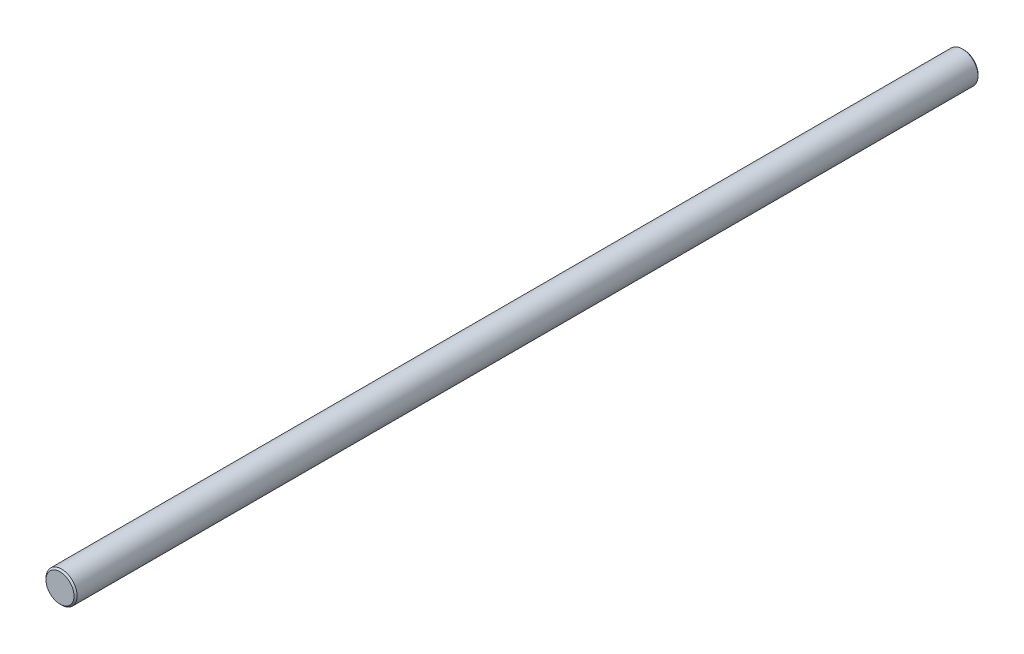
ISO-10303-21;
HEADER;
FILE_DESCRIPTION(('STEP AP214'),'2;1');
FILE_NAME('part.step','',(''),(''),'','','');
FILE_SCHEMA(('AUTOMOTIVE_DESIGN { 1 0 10303 214 1 1 1 1 }'));
ENDSEC;
DATA;
#1=APPLICATION_CONTEXT('core data for automotive mechanical design processes');
#2=APPLICATION_PROTOCOL_DEFINITION('international standard','automotive_design',2000,#1);
#3=PRODUCT_CONTEXT('',#1,'mechanical');
#4=PRODUCT('Part','Part','',(#3));
#5=PRODUCT_RELATED_PRODUCT_CATEGORY('part','',(#4));
#6=PRODUCT_DEFINITION_FORMATION('','',#4);
#7=PRODUCT_DEFINITION_CONTEXT('part definition',#1,'design');
#8=PRODUCT_DEFINITION('design','',#6,#7);
#9=PRODUCT_DEFINITION_SHAPE('','',#8);
#10=(LENGTH_UNIT() NAMED_UNIT(*) SI_UNIT(.MILLI.,.METRE.));
#11=(NAMED_UNIT(*) PLANE_ANGLE_UNIT() SI_UNIT($,.RADIAN.));
#12=(NAMED_UNIT(*) SI_UNIT($,.STERADIAN.) SOLID_ANGLE_UNIT());
#13=UNCERTAINTY_MEASURE_WITH_UNIT(LENGTH_MEASURE(1.E-05),#10,'distance_accuracy_value','');
#14=(GEOMETRIC_REPRESENTATION_CONTEXT(3) GLOBAL_UNCERTAINTY_ASSIGNED_CONTEXT((#13)) GLOBAL_UNIT_ASSIGNED_CONTEXT((#10,
#11,#12)) REPRESENTATION_CONTEXT('',''));
#15=CARTESIAN_POINT('',(0.,0.,0.));
#16=DIRECTION('',(0.,0.,1.));
#17=DIRECTION('',(1.,0.,0.));
#18=AXIS2_PLACEMENT_3D('',#15,#16,#17);
#19=CARTESIAN_POINT('',(0.,0.,290.));
#20=DIRECTION('',(0.,0.,-1.));
#21=DIRECTION('',(-1.,0.,0.));
#22=AXIS2_PLACEMENT_3D('',#19,#20,#21);
#23=CYLINDRICAL_SURFACE('',#22,5.);
#24=CARTESIAN_POINT('',(0.,0.,289.5));
#25=DIRECTION('',(0.,0.,1.));
#26=DIRECTION('',(1.,0.,0.));
#27=AXIS2_PLACEMENT_3D('',#24,#25,#26);
#28=CIRCLE('',#27,5.);
#29=CARTESIAN_POINT('',(5.,0.,289.5));
#30=VERTEX_POINT('',#29);
#31=EDGE_CURVE('E37',#30,#30,#28,.F.);
#32=ORIENTED_EDGE('',*,*,#31,.T.);
#33=EDGE_LOOP('',(#32));
#34=FACE_BOUND('',#33,.T.);
#35=CARTESIAN_POINT('',(0.,0.,0.5));
#36=DIRECTION('',(0.,0.,1.));
#37=DIRECTION('',(1.,0.,0.));
#38=AXIS2_PLACEMENT_3D('',#35,#36,#37);
#39=CIRCLE('',#38,5.);
#40=CARTESIAN_POINT('',(5.,0.,0.5));
#41=VERTEX_POINT('',#40);
#42=EDGE_CURVE('E41',#41,#41,#39,.T.);
#43=ORIENTED_EDGE('',*,*,#42,.T.);
#44=EDGE_LOOP('',(#43));
#45=FACE_BOUND('',#44,.T.);
#46=ADVANCED_FACE('F30',(#34,#45),#23,.T.);
#47=CARTESIAN_POINT('',(0.,0.,290.));
#48=DIRECTION('',(0.,0.,1.));
#49=DIRECTION('',(1.,0.,0.));
#50=AXIS2_PLACEMENT_3D('',#47,#48,#49);
#51=PLANE('',#50);
#52=CARTESIAN_POINT('',(0.,0.,290.));
#53=DIRECTION('',(0.,0.,1.));
#54=DIRECTION('',(1.,0.,0.));
#55=AXIS2_PLACEMENT_3D('',#52,#53,#54);
#56=CIRCLE('',#55,4.50000000000003);
#57=CARTESIAN_POINT('',(4.50000000000003,0.,290.));
#58=VERTEX_POINT('',#57);
#59=EDGE_CURVE('E45',#58,#58,#56,.T.);
#60=ORIENTED_EDGE('',*,*,#59,.T.);
#61=EDGE_LOOP('',(#60));
#62=FACE_BOUND('',#61,.T.);
#63=ADVANCED_FACE('F51',(#62),#51,.T.);
#64=CARTESIAN_POINT('',(0.,0.,0.));
#65=DIRECTION('',(0.,0.,1.));
#66=DIRECTION('',(1.,0.,0.));
#67=AXIS2_PLACEMENT_3D('',#64,#65,#66);
#68=PLANE('',#67);
#69=CARTESIAN_POINT('',(0.,0.,0.));
#70=DIRECTION('',(0.,0.,1.));
#71=DIRECTION('',(1.,0.,0.));
#72=AXIS2_PLACEMENT_3D('',#69,#70,#71);
#73=CIRCLE('',#72,4.5);
#74=CARTESIAN_POINT('',(4.5,0.,0.));
#75=VERTEX_POINT('',#74);
#76=EDGE_CURVE('E10',#75,#75,#73,.F.);
#77=ORIENTED_EDGE('',*,*,#76,.T.);
#78=EDGE_LOOP('',(#77));
#79=FACE_BOUND('',#78,.T.);
#80=ADVANCED_FACE('F55',(#79),#68,.F.);
#81=CARTESIAN_POINT('',(0.,0.,290.));
#82=DIRECTION('',(0.,0.,-1.));
#83=DIRECTION('',(-1.,0.,0.));
#84=AXIS2_PLACEMENT_3D('',#81,#82,#83);
#85=CONICAL_SURFACE('',#84,4.50000000000003,0.785398163397416);
#86=ORIENTED_EDGE('',*,*,#31,.F.);
#87=EDGE_LOOP('',(#86));
#88=FACE_BOUND('',#87,.T.);
#89=ORIENTED_EDGE('',*,*,#59,.F.);
#90=EDGE_LOOP('',(#89));
#91=FACE_BOUND('',#90,.T.);
#92=ADVANCED_FACE('F53',(#88,#91),#85,.T.);
#93=CARTESIAN_POINT('',(0.,0.,0.5));
#94=DIRECTION('',(0.,0.,1.));
#95=DIRECTION('',(1.,0.,0.));
#96=AXIS2_PLACEMENT_3D('',#93,#94,#95);
#97=CONICAL_SURFACE('',#96,5.,0.785398163397444);
#98=ORIENTED_EDGE('',*,*,#76,.F.);
#99=EDGE_LOOP('',(#98));
#100=FACE_BOUND('',#99,.T.);
#101=ORIENTED_EDGE('',*,*,#42,.F.);
#102=EDGE_LOOP('',(#101));
#103=FACE_BOUND('',#102,.T.);
#104=ADVANCED_FACE('F32',(#100,#103),#97,.T.);
#105=CLOSED_SHELL('',(#46,#63,#80,#92,#104));
#106=MANIFOLD_SOLID_BREP('B2',#105);
#107=ADVANCED_BREP_SHAPE_REPRESENTATION('',(#18,#106),#14);
#108=SHAPE_DEFINITION_REPRESENTATION(#9,#107);
ENDSEC;
END-ISO-10303-21;
